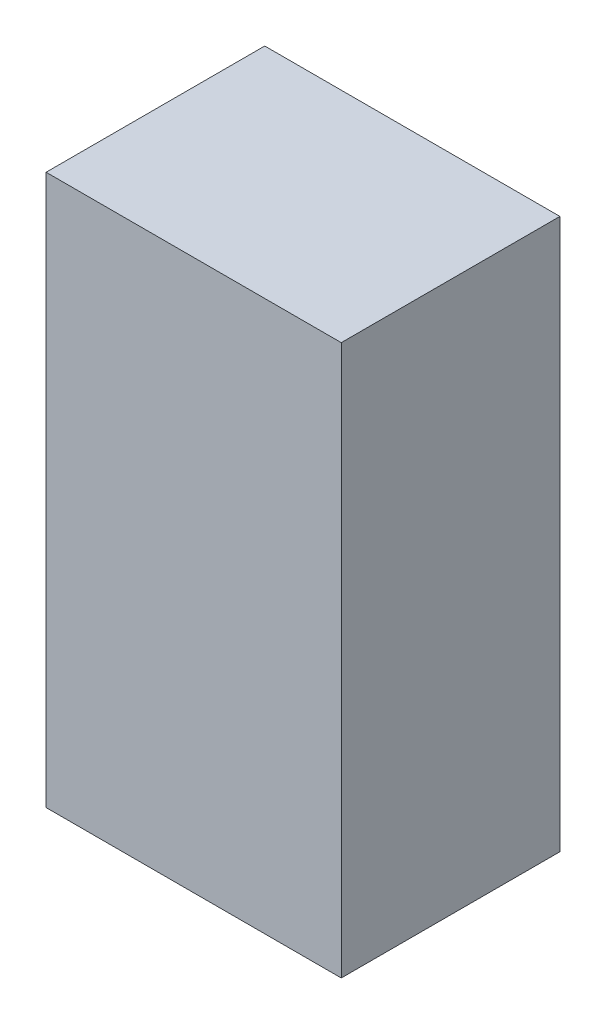
ISO-10303-21;
HEADER;
FILE_DESCRIPTION(('STEP AP214'),'2;1');
FILE_NAME('part.step','',(''),(''),'','','');
FILE_SCHEMA(('AUTOMOTIVE_DESIGN { 1 0 10303 214 1 1 1 1 }'));
ENDSEC;
DATA;
#1=APPLICATION_CONTEXT('core data for automotive mechanical design processes');
#2=APPLICATION_PROTOCOL_DEFINITION('international standard','automotive_design',2000,#1);
#3=PRODUCT_CONTEXT('',#1,'mechanical');
#4=PRODUCT('Part','Part','',(#3));
#5=PRODUCT_RELATED_PRODUCT_CATEGORY('part','',(#4));
#6=PRODUCT_DEFINITION_FORMATION('','',#4);
#7=PRODUCT_DEFINITION_CONTEXT('part definition',#1,'design');
#8=PRODUCT_DEFINITION('design','',#6,#7);
#9=PRODUCT_DEFINITION_SHAPE('','',#8);
#10=(LENGTH_UNIT() NAMED_UNIT(*) SI_UNIT(.MILLI.,.METRE.));
#11=(NAMED_UNIT(*) PLANE_ANGLE_UNIT() SI_UNIT($,.RADIAN.));
#12=(NAMED_UNIT(*) SI_UNIT($,.STERADIAN.) SOLID_ANGLE_UNIT());
#13=UNCERTAINTY_MEASURE_WITH_UNIT(LENGTH_MEASURE(1.E-05),#10,'distance_accuracy_value','');
#14=(GEOMETRIC_REPRESENTATION_CONTEXT(3) GLOBAL_UNCERTAINTY_ASSIGNED_CONTEXT((#13)) GLOBAL_UNIT_ASSIGNED_CONTEXT((#10,
#11,#12)) REPRESENTATION_CONTEXT('',''));
#15=CARTESIAN_POINT('',(0.,0.,0.));
#16=DIRECTION('',(0.,0.,1.));
#17=DIRECTION('',(1.,0.,0.));
#18=AXIS2_PLACEMENT_3D('',#15,#16,#17);
#19=CARTESIAN_POINT('',(-0.40499792,0.75499976,0.5999988));
#20=DIRECTION('',(0.,0.,1.));
#21=DIRECTION('',(1.,0.,0.));
#22=AXIS2_PLACEMENT_3D('',#19,#20,#21);
#23=PLANE('',#22);
#24=DIRECTION('',(0.,1.,0.));
#25=VECTOR('',#24,1.);
#26=CARTESIAN_POINT('',(-0.40499792,-0.75499976,0.5999988));
#27=LINE('',#26,#25);
#28=CARTESIAN_POINT('',(-0.40499792,-0.75499976,0.5999988));
#29=VERTEX_POINT('',#28);
#30=CARTESIAN_POINT('',(-0.40499792,0.75499976,0.5999988));
#31=VERTEX_POINT('',#30);
#32=EDGE_CURVE('E20',#29,#31,#27,.T.);
#33=ORIENTED_EDGE('',*,*,#32,.F.);
#34=DIRECTION('',(-1.,0.,0.));
#35=VECTOR('',#34,1.);
#36=CARTESIAN_POINT('',(0.40499792,-0.75499976,0.5999988));
#37=LINE('',#36,#35);
#38=CARTESIAN_POINT('',(0.40499792,-0.75499976,0.5999988));
#39=VERTEX_POINT('',#38);
#40=EDGE_CURVE('E59',#39,#29,#37,.T.);
#41=ORIENTED_EDGE('',*,*,#40,.F.);
#42=DIRECTION('',(0.,-1.,0.));
#43=VECTOR('',#42,1.);
#44=CARTESIAN_POINT('',(0.40499792,0.75499976,0.5999988));
#45=LINE('',#44,#43);
#46=CARTESIAN_POINT('',(0.40499792,0.75499976,0.5999988));
#47=VERTEX_POINT('',#46);
#48=EDGE_CURVE('E87',#47,#39,#45,.T.);
#49=ORIENTED_EDGE('',*,*,#48,.F.);
#50=DIRECTION('',(1.,0.,0.));
#51=VECTOR('',#50,1.);
#52=CARTESIAN_POINT('',(-0.40499792,0.75499976,0.5999988));
#53=LINE('',#52,#51);
#54=EDGE_CURVE('E103',#31,#47,#53,.T.);
#55=ORIENTED_EDGE('',*,*,#54,.F.);
#56=EDGE_LOOP('',(#33,#41,#49,#55));
#57=FACE_BOUND('',#56,.T.);
#58=ADVANCED_FACE('F17',(#57),#23,.T.);
#59=CARTESIAN_POINT('',(-0.40499792,0.75499976,0.));
#60=DIRECTION('',(0.,0.,1.));
#61=DIRECTION('',(1.,0.,0.));
#62=AXIS2_PLACEMENT_3D('',#59,#60,#61);
#63=PLANE('',#62);
#64=DIRECTION('',(1.,0.,0.));
#65=VECTOR('',#64,1.);
#66=CARTESIAN_POINT('',(-0.40499792,0.75499976,0.));
#67=LINE('',#66,#65);
#68=CARTESIAN_POINT('',(-0.40499792,0.75499976,0.));
#69=VERTEX_POINT('',#68);
#70=CARTESIAN_POINT('',(0.40499792,0.75499976,0.));
#71=VERTEX_POINT('',#70);
#72=EDGE_CURVE('E80',#69,#71,#67,.T.);
#73=ORIENTED_EDGE('',*,*,#72,.T.);
#74=DIRECTION('',(0.,-1.,0.));
#75=VECTOR('',#74,1.);
#76=CARTESIAN_POINT('',(0.40499792,0.75499976,0.));
#77=LINE('',#76,#75);
#78=CARTESIAN_POINT('',(0.40499792,-0.75499976,0.));
#79=VERTEX_POINT('',#78);
#80=EDGE_CURVE('E77',#71,#79,#77,.T.);
#81=ORIENTED_EDGE('',*,*,#80,.T.);
#82=DIRECTION('',(-1.,0.,0.));
#83=VECTOR('',#82,1.);
#84=CARTESIAN_POINT('',(0.40499792,-0.75499976,0.));
#85=LINE('',#84,#83);
#86=CARTESIAN_POINT('',(-0.40499792,-0.75499976,0.));
#87=VERTEX_POINT('',#86);
#88=EDGE_CURVE('E67',#79,#87,#85,.T.);
#89=ORIENTED_EDGE('',*,*,#88,.T.);
#90=DIRECTION('',(0.,1.,0.));
#91=VECTOR('',#90,1.);
#92=CARTESIAN_POINT('',(-0.40499792,-0.75499976,0.));
#93=LINE('',#92,#91);
#94=EDGE_CURVE('E11',#87,#69,#93,.T.);
#95=ORIENTED_EDGE('',*,*,#94,.T.);
#96=EDGE_LOOP('',(#73,#81,#89,#95));
#97=FACE_BOUND('',#96,.T.);
#98=ADVANCED_FACE('F78',(#97),#63,.F.);
#99=CARTESIAN_POINT('',(-0.40499792,-0.75499976,0.));
#100=DIRECTION('',(-1.,0.,0.));
#101=DIRECTION('',(0.,0.,1.));
#102=AXIS2_PLACEMENT_3D('',#99,#100,#101);
#103=PLANE('',#102);
#104=DIRECTION('',(0.,0.,1.));
#105=VECTOR('',#104,1.);
#106=CARTESIAN_POINT('',(-0.40499792,-0.75499976,0.));
#107=LINE('',#106,#105);
#108=EDGE_CURVE('E73',#87,#29,#107,.T.);
#109=ORIENTED_EDGE('',*,*,#108,.T.);
#110=ORIENTED_EDGE('',*,*,#32,.T.);
#111=DIRECTION('',(0.,0.,1.));
#112=VECTOR('',#111,1.);
#113=CARTESIAN_POINT('',(-0.40499792,0.75499976,0.));
#114=LINE('',#113,#112);
#115=EDGE_CURVE('E107',#69,#31,#114,.T.);
#116=ORIENTED_EDGE('',*,*,#115,.F.);
#117=ORIENTED_EDGE('',*,*,#94,.F.);
#118=EDGE_LOOP('',(#109,#110,#116,#117));
#119=FACE_BOUND('',#118,.T.);
#120=ADVANCED_FACE('F119',(#119),#103,.T.);
#121=CARTESIAN_POINT('',(0.40499792,-0.75499976,0.));
#122=DIRECTION('',(0.,-1.,0.));
#123=DIRECTION('',(0.,0.,-1.));
#124=AXIS2_PLACEMENT_3D('',#121,#122,#123);
#125=PLANE('',#124);
#126=DIRECTION('',(0.,0.,1.));
#127=VECTOR('',#126,1.);
#128=CARTESIAN_POINT('',(0.40499792,-0.75499976,0.));
#129=LINE('',#128,#127);
#130=EDGE_CURVE('E71',#79,#39,#129,.T.);
#131=ORIENTED_EDGE('',*,*,#130,.T.);
#132=ORIENTED_EDGE('',*,*,#40,.T.);
#133=ORIENTED_EDGE('',*,*,#108,.F.);
#134=ORIENTED_EDGE('',*,*,#88,.F.);
#135=EDGE_LOOP('',(#131,#132,#133,#134));
#136=FACE_BOUND('',#135,.T.);
#137=ADVANCED_FACE('F69',(#136),#125,.T.);
#138=CARTESIAN_POINT('',(0.40499792,0.75499976,0.));
#139=DIRECTION('',(1.,0.,0.));
#140=DIRECTION('',(0.,1.,0.));
#141=AXIS2_PLACEMENT_3D('',#138,#139,#140);
#142=PLANE('',#141);
#143=DIRECTION('',(0.,0.,1.));
#144=VECTOR('',#143,1.);
#145=CARTESIAN_POINT('',(0.40499792,0.75499976,0.));
#146=LINE('',#145,#144);
#147=EDGE_CURVE('E102',#71,#47,#146,.T.);
#148=ORIENTED_EDGE('',*,*,#147,.T.);
#149=ORIENTED_EDGE('',*,*,#48,.T.);
#150=ORIENTED_EDGE('',*,*,#130,.F.);
#151=ORIENTED_EDGE('',*,*,#80,.F.);
#152=EDGE_LOOP('',(#148,#149,#150,#151));
#153=FACE_BOUND('',#152,.T.);
#154=ADVANCED_FACE('F86',(#153),#142,.T.);
#155=CARTESIAN_POINT('',(-0.40499792,0.75499976,0.));
#156=DIRECTION('',(0.,1.,0.));
#157=DIRECTION('',(1.,0.,0.));
#158=AXIS2_PLACEMENT_3D('',#155,#156,#157);
#159=PLANE('',#158);
#160=ORIENTED_EDGE('',*,*,#115,.T.);
#161=ORIENTED_EDGE('',*,*,#54,.T.);
#162=ORIENTED_EDGE('',*,*,#147,.F.);
#163=ORIENTED_EDGE('',*,*,#72,.F.);
#164=EDGE_LOOP('',(#160,#161,#162,#163));
#165=FACE_BOUND('',#164,.T.);
#166=ADVANCED_FACE('F115',(#165),#159,.T.);
#167=CLOSED_SHELL('',(#58,#98,#120,#137,#154,#166));
#168=MANIFOLD_SOLID_BREP('B1',#167);
#169=ADVANCED_BREP_SHAPE_REPRESENTATION('',(#18,#168),#14);
#170=SHAPE_DEFINITION_REPRESENTATION(#9,#169);
ENDSEC;
END-ISO-10303-21;
